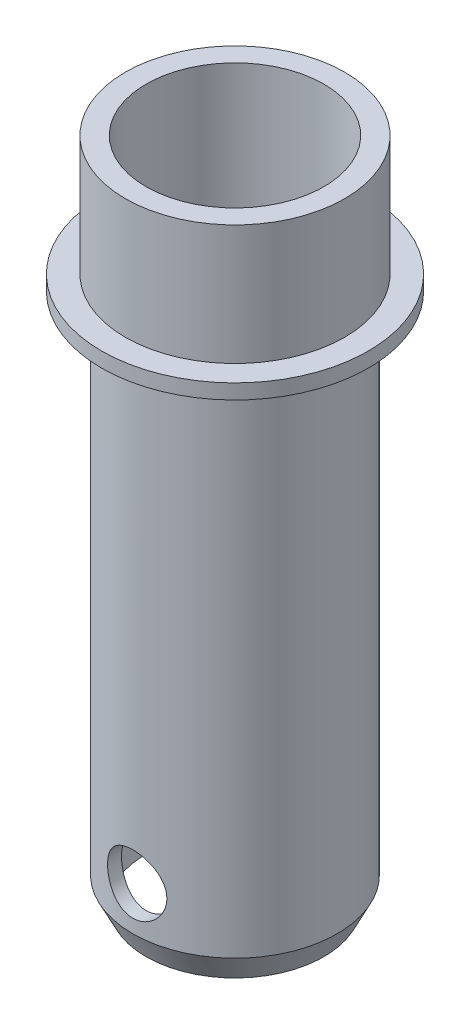
ISO-10303-21;
HEADER;
FILE_DESCRIPTION(('STEP AP214'),'2;1');
FILE_NAME('part.step','',(''),(''),'','','');
FILE_SCHEMA(('AUTOMOTIVE_DESIGN { 1 0 10303 214 1 1 1 1 }'));
ENDSEC;
DATA;
#1=APPLICATION_CONTEXT('core data for automotive mechanical design processes');
#2=APPLICATION_PROTOCOL_DEFINITION('international standard','automotive_design',2000,#1);
#3=PRODUCT_CONTEXT('',#1,'mechanical');
#4=PRODUCT('Part','Part','',(#3));
#5=PRODUCT_RELATED_PRODUCT_CATEGORY('part','',(#4));
#6=PRODUCT_DEFINITION_FORMATION('','',#4);
#7=PRODUCT_DEFINITION_CONTEXT('part definition',#1,'design');
#8=PRODUCT_DEFINITION('design','',#6,#7);
#9=PRODUCT_DEFINITION_SHAPE('','',#8);
#10=(LENGTH_UNIT() NAMED_UNIT(*) SI_UNIT(.MILLI.,.METRE.));
#11=(NAMED_UNIT(*) PLANE_ANGLE_UNIT() SI_UNIT($,.RADIAN.));
#12=(NAMED_UNIT(*) SI_UNIT($,.STERADIAN.) SOLID_ANGLE_UNIT());
#13=UNCERTAINTY_MEASURE_WITH_UNIT(LENGTH_MEASURE(1.E-05),#10,'distance_accuracy_value','');
#14=(GEOMETRIC_REPRESENTATION_CONTEXT(3) GLOBAL_UNCERTAINTY_ASSIGNED_CONTEXT((#13)) GLOBAL_UNIT_ASSIGNED_CONTEXT((#10,
#11,#12)) REPRESENTATION_CONTEXT('',''));
#15=CARTESIAN_POINT('',(0.,0.,0.));
#16=DIRECTION('',(0.,0.,1.));
#17=DIRECTION('',(1.,0.,0.));
#18=AXIS2_PLACEMENT_3D('',#15,#16,#17);
#19=CARTESIAN_POINT('',(0.,30.7122905027933,0.));
#20=DIRECTION('',(0.,1.,0.));
#21=DIRECTION('',(0.,0.,1.));
#22=AXIS2_PLACEMENT_3D('',#19,#20,#21);
#23=CYLINDRICAL_SURFACE('',#22,5.99999999999999);
#24=CARTESIAN_POINT('',(0.,-33.2,5.99999999999999));
#25=CARTESIAN_POINT('',(-0.109126725773446,-33.2000005074633,6.00000030601887));
#26=CARTESIAN_POINT('',(-0.2182503890771,-33.1910394677456,5.99699539015089));
#27=CARTESIAN_POINT('',(-0.433283521745944,-33.1555417823656,5.98530420406561));
#28=CARTESIAN_POINT('',(-0.539192656237635,-33.1290033121022,5.97661734404304));
#29=CARTESIAN_POINT('',(-0.744665579003551,-33.0593615132319,5.95450615812885));
#30=CARTESIAN_POINT('',(-0.844239651772067,-33.0162858750815,5.94108975461706));
#31=CARTESIAN_POINT('',(-1.03474987361065,-32.9149176543233,5.91088891434683));
#32=CARTESIAN_POINT('',(-1.12568431391741,-32.8566220699948,5.89410381335555));
#33=CARTESIAN_POINT('',(-1.29948335004453,-32.7243483902825,5.85828188886009));
#34=CARTESIAN_POINT('',(-1.38200740059662,-32.649937531479,5.83919112927569));
#35=CARTESIAN_POINT('',(-1.53366538540417,-32.4884656905869,5.80120629566242));
#36=CARTESIAN_POINT('',(-1.60279637097892,-32.401401930143,5.78231226581097));
#37=CARTESIAN_POINT('',(-1.72764988445572,-32.2140297696071,5.74626664954547));
#38=CARTESIAN_POINT('',(-1.78292971644206,-32.1134125205358,5.72918078551375));
#39=CARTESIAN_POINT('',(-1.87563774775544,-31.9036478110829,5.69950610837201));
#40=CARTESIAN_POINT('',(-1.91307139477353,-31.7945029656745,5.6869159232149));
#41=CARTESIAN_POINT('',(-1.96774692301833,-31.5746535570066,5.66822606538754));
#42=CARTESIAN_POINT('',(-1.98562689654354,-31.4641255830219,5.66192191539222));
#43=CARTESIAN_POINT('',(-2.00268224666896,-31.2414724916882,5.65591313259014));
#44=CARTESIAN_POINT('',(-2.00186340320944,-31.1293478785816,5.65620646045459));
#45=CARTESIAN_POINT('',(-1.98203980740684,-30.912126739112,5.66318030016359));
#46=CARTESIAN_POINT('',(-1.96386782633399,-30.806943194162,5.66956831735065));
#47=CARTESIAN_POINT('',(-1.91121232569884,-30.6012131607863,5.68753315449101));
#48=CARTESIAN_POINT('',(-1.87672685318374,-30.5006672291299,5.69911059568214));
#49=CARTESIAN_POINT('',(-1.79187811612042,-30.305174500817,5.72635822262497));
#50=CARTESIAN_POINT('',(-1.74126809741453,-30.210343949061,5.74209131586234));
#51=CARTESIAN_POINT('',(-1.62577821260628,-30.0302581834406,5.77585117151452));
#52=CARTESIAN_POINT('',(-1.56089422472801,-29.9450057461332,5.79387859580926));
#53=CARTESIAN_POINT('',(-1.41469866536448,-29.7818168036785,5.83134658335481));
#54=CARTESIAN_POINT('',(-1.33270630015262,-29.7044946109819,5.85081178709685));
#55=CARTESIAN_POINT('',(-1.15667913994013,-29.5645374666732,5.88813876774073));
#56=CARTESIAN_POINT('',(-1.06264319132163,-29.501903923671,5.90600039076134));
#57=CARTESIAN_POINT('',(-0.863895226092539,-29.3926073995299,5.93834215875586));
#58=CARTESIAN_POINT('',(-0.759086552832677,-29.3461090173185,5.95278700016078));
#59=CARTESIAN_POINT('',(-0.542538166729018,-29.2715936520886,5.97641134288869));
#60=CARTESIAN_POINT('',(-0.43080087630991,-29.2435702491531,5.98559267309758));
#61=CARTESIAN_POINT('',(-0.20876765905861,-29.2078886679553,5.9973525414288));
#62=CARTESIAN_POINT('',(-0.0986191997296948,-29.1994003816545,6.00020003667455));
#63=CARTESIAN_POINT('',(0.121550139920472,-29.2006653471969,5.99977805389654));
#64=CARTESIAN_POINT('',(0.231571038639298,-29.2104155199598,5.99650960838724));
#65=CARTESIAN_POINT('',(0.445039732608509,-29.2472238154719,5.98440049434208));
#66=CARTESIAN_POINT('',(0.548585613669685,-29.273772412099,5.97572397422384));
#67=CARTESIAN_POINT('',(0.749711917159145,-29.3427868889335,5.95383693660139));
#68=CARTESIAN_POINT('',(0.84729157701721,-29.3852547989356,5.94062584093349));
#69=CARTESIAN_POINT('',(1.03657659278654,-29.4861408636816,5.91057862574579));
#70=CARTESIAN_POINT('',(1.12805991843429,-29.5449491865663,5.89365629511571));
#71=CARTESIAN_POINT('',(1.30012966027117,-29.676388300027,5.85810507832524));
#72=CARTESIAN_POINT('',(1.38071273559115,-29.7490233120635,5.83947567187654));
#73=CARTESIAN_POINT('',(1.5325050156126,-29.9099575020132,5.80153695960889));
#74=CARTESIAN_POINT('',(1.60312193849154,-29.9988184538537,5.78223522174855));
#75=CARTESIAN_POINT('',(1.72851504464715,-30.1875431356218,5.74599946589417));
#76=CARTESIAN_POINT('',(1.78329109586203,-30.2874069572682,5.72906546764004));
#77=CARTESIAN_POINT('',(1.87519386083272,-30.4953460305798,5.69964783582766));
#78=CARTESIAN_POINT('',(1.91235626433004,-30.6034041583375,5.68715521585957));
#79=CARTESIAN_POINT('',(1.96778933351871,-30.8247573000883,5.66821664612898));
#80=CARTESIAN_POINT('',(1.98606850990788,-30.9380499308087,5.66176797247278));
#81=CARTESIAN_POINT('',(2.00255256495468,-31.1603941920818,5.65595717748353));
#82=CARTESIAN_POINT('',(2.0017405146168,-31.2693646805736,5.65624800514829));
#83=CARTESIAN_POINT('',(1.98248458689739,-31.4855301498441,5.66302539647734));
#84=CARTESIAN_POINT('',(1.96404175891717,-31.5927252359102,5.66951159138722));
#85=CARTESIAN_POINT('',(1.91074362625869,-31.8002713260049,5.68769048609783));
#86=CARTESIAN_POINT('',(1.87620669203103,-31.900713650009,5.69928196044954));
#87=CARTESIAN_POINT('',(1.7919587315195,-32.0944548138765,5.72632797636936));
#88=CARTESIAN_POINT('',(1.74224433710761,-32.187752062376,5.74178337526785));
#89=CARTESIAN_POINT('',(1.62652138516686,-32.3689673398458,5.77565658452092));
#90=CARTESIAN_POINT('',(1.55989648552916,-32.4564730037968,5.79417423284273));
#91=CARTESIAN_POINT('',(1.4132857662713,-32.6193796267684,5.83166712566505));
#92=CARTESIAN_POINT('',(1.33329616890297,-32.6947771513762,5.85064249824744));
#93=CARTESIAN_POINT('',(1.15848311384138,-32.8342888245784,5.88780061051087));
#94=CARTESIAN_POINT('',(1.06320302699947,-32.897848695502,5.90592363602512));
#95=CARTESIAN_POINT('',(0.862714714813257,-33.0079808577013,5.93851982345223));
#96=CARTESIAN_POINT('',(0.757509036264702,-33.0545574918441,5.95299391815859));
#97=CARTESIAN_POINT('',(0.544987294401954,-33.1274432649773,5.97611030137083));
#98=CARTESIAN_POINT('',(0.437975515352819,-33.1545649325268,5.98498424845044));
#99=CARTESIAN_POINT('',(0.220640832020495,-33.1908405613543,5.99692814128443));
#100=CARTESIAN_POINT('',(0.110318851137493,-33.1999994869931,5.99999969063809));
#101=CARTESIAN_POINT('',(0.,-33.2,5.99999999999999));
#102=B_SPLINE_CURVE_WITH_KNOTS('',3,(#24,#25,#26,#27,#28,#29,#30,#31,#32,#33,#34,#35,#36,#37,
#38,#39,#40,#41,#42,#43,#44,#45,#46,#47,#48,#49,#50,#51,#52,#53,#54,#55,#56,#57,#58,#59,#60,#61,
#62,#63,#64,#65,#66,#67,#68,#69,#70,#71,#72,#73,#74,#75,#76,#77,#78,#79,#80,#81,#82,#83,#84,#85,
#86,#87,#88,#89,#90,#91,#92,#93,#94,#95,#96,#97,#98,#99,#100,#101),.UNSPECIFIED.,.T.,.F.,(4,2,2,
2,2,2,2,2,2,2,2,2,2,2,2,2,2,2,2,2,2,2,2,2,2,2,2,2,2,2,2,2,2,2,2,2,2,2,4),(0.,0.326974212052022,
0.65398237053504,0.980445345740546,1.3069727555982,1.64369368565512,1.9804886657506,
2.32696769646941,2.67334089385666,3.00803851483679,3.34263267974971,3.66193653102561,
3.98127861710964,4.30576342310261,4.63034205116414,4.97186611622734,5.31342291933236,
5.65836811300715,6.00319337754416,6.33307166350339,6.66289426328353,6.98316315956427,
7.30347290568208,7.63220799687473,7.96104361643782,8.30482045761504,8.64860016469993,
8.99168027653541,9.3346056941168,9.65991332128517,9.9852015870275,10.3043117416083,
10.6234927635195,10.9566013338361,11.2898042224756,11.635993216702,11.9820936230491,
12.3127311674763,12.6432773207628),.UNSPECIFIED.);
#103=CARTESIAN_POINT('',(0.,-33.2,5.99999999999999));
#104=VERTEX_POINT('',#103);
#105=EDGE_CURVE('E74',#104,#104,#102,.T.);
#106=ORIENTED_EDGE('',*,*,#105,.F.);
#107=EDGE_LOOP('',(#106));
#108=FACE_BOUND('',#107,.T.);
#109=CARTESIAN_POINT('',(2.,-31.2,-5.65685424949237));
#110=CARTESIAN_POINT('',(2.00000051589543,-31.0910636503279,-5.65685389060867));
#111=CARTESIAN_POINT('',(1.99106956737105,-30.9821304003528,-5.66003538581714));
#112=CARTESIAN_POINT('',(1.95570226337762,-30.7674911580115,-5.67235148162509));
#113=CARTESIAN_POINT('',(1.9292630243368,-30.6617857002551,-5.68148706284377));
#114=CARTESIAN_POINT('',(1.85991097136981,-30.4567462140054,-5.70456407377582));
#115=CARTESIAN_POINT('',(1.81703044280649,-30.3574001411146,-5.71849607942643));
#116=CARTESIAN_POINT('',(1.71612325688276,-30.1672799029041,-5.74958244020649));
#117=CARTESIAN_POINT('',(1.65809325772037,-30.0765076348927,-5.76673750607224));
#118=CARTESIAN_POINT('',(1.52610229288576,-29.9025600753234,-5.80308978814945));
#119=CARTESIAN_POINT('',(1.45164868275584,-29.8197691426566,-5.82233789689287));
#120=CARTESIAN_POINT('',(1.28997533442879,-29.6675863975507,-5.86027729602005));
#121=CARTESIAN_POINT('',(1.20275355010475,-29.5981967368353,-5.87896849657922));
#122=CARTESIAN_POINT('',(1.01520901593002,-29.4730422053408,-5.91427733843597));
#123=CARTESIAN_POINT('',(0.914603822449051,-29.4176800587641,-5.9308281540321));
#124=CARTESIAN_POINT('',(0.704862445974948,-29.324816829745,-5.95939173541965));
#125=CARTESIAN_POINT('',(0.595728571374425,-29.2873109336462,-5.97140572406003));
#126=CARTESIAN_POINT('',(0.37605763486699,-29.2325282907352,-5.98918150863812));
#127=CARTESIAN_POINT('',(0.265701509705938,-29.214593107486,-5.99514629555117));
#128=CARTESIAN_POINT('',(0.0433957496481806,-29.1973674132787,-6.00087216436495));
#129=CARTESIAN_POINT('',(-0.0685534670877907,-29.1980720966952,-6.0006348452579));
#130=CARTESIAN_POINT('',(-0.286207030387627,-29.2176885091321,-5.99412079237462));
#131=CARTESIAN_POINT('',(-0.391984097183312,-29.235885056949,-5.98808129510234));
#132=CARTESIAN_POINT('',(-0.598886877644342,-29.2887859619609,-5.97093934679462));
#133=CARTESIAN_POINT('',(-0.700012275558431,-29.3234914379596,-5.95983655262363));
#134=CARTESIAN_POINT('',(-0.896304949683944,-29.4088426346121,-5.93351340586448));
#135=CARTESIAN_POINT('',(-0.991376441937689,-29.459691877093,-5.9182408504803));
#136=CARTESIAN_POINT('',(-1.17184865105464,-29.5757194108973,-5.88516786077837));
#137=CARTESIAN_POINT('',(-1.25724666877068,-29.6409016866553,-5.86736672402933));
#138=CARTESIAN_POINT('',(-1.42020173310261,-29.7873487869194,-5.83012383699792));
#139=CARTESIAN_POINT('',(-1.49720031413054,-29.869226315683,-5.81064430337755));
#140=CARTESIAN_POINT('',(-1.63655451919635,-30.0448974514532,-5.772946704978));
#141=CARTESIAN_POINT('',(-1.69890788656308,-30.1386928914561,-5.7547288349123));
#142=CARTESIAN_POINT('',(-1.80797491007148,-30.3373072512069,-5.72141050242224));
#143=CARTESIAN_POINT('',(-1.85445292724268,-30.4422642626355,-5.70635818569495));
#144=CARTESIAN_POINT('',(-1.92888638653867,-30.6591427884288,-5.68163301648769));
#145=CARTESIAN_POINT('',(-1.95684959149499,-30.7710613624125,-5.67195790974184));
#146=CARTESIAN_POINT('',(-1.99232256419504,-30.9932767108231,-5.65959272631169));
#147=CARTESIAN_POINT('',(-2.00069819101527,-31.1034188494973,-5.65660720637511));
#148=CARTESIAN_POINT('',(-1.99921087781944,-31.3235522982282,-5.65713344118368));
#149=CARTESIAN_POINT('',(-1.98935125045353,-31.433543632048,-5.66064401583628));
#150=CARTESIAN_POINT('',(-1.95245130310462,-31.6463139314238,-5.67347236180598));
#151=CARTESIAN_POINT('',(-1.92601278796137,-31.7492108603017,-5.6825865088168));
#152=CARTESIAN_POINT('',(-1.85742772512093,-31.9490872124784,-5.70537107342045));
#153=CARTESIAN_POINT('',(-1.81527839272684,-32.0460655831816,-5.71904229869678));
#154=CARTESIAN_POINT('',(-1.71494868147787,-32.234760841694,-5.74993755191573));
#155=CARTESIAN_POINT('',(-1.65630223671699,-32.3262132852836,-5.76726051331256));
#156=CARTESIAN_POINT('',(-1.52517126111512,-32.4982921047674,-5.8033153746193));
#157=CARTESIAN_POINT('',(-1.45268265099756,-32.5789152773224,-5.82204768887588));
#158=CARTESIAN_POINT('',(-1.29178341180065,-32.7310559681813,-5.85990077275697));
#159=CARTESIAN_POINT('',(-1.2027745410933,-32.8019487800377,-5.87899687155792));
#160=CARTESIAN_POINT('',(-1.01365458280051,-32.9278322846961,-5.91453703226217));
#161=CARTESIAN_POINT('',(-0.913543889729103,-32.9828235423249,-5.93098118835389));
#162=CARTESIAN_POINT('',(-0.705559724864591,-33.0748402097234,-5.95928811621205));
#163=CARTESIAN_POINT('',(-0.597742246642392,-33.1119825542961,-5.97118060009061));
#164=CARTESIAN_POINT('',(-0.376916931692033,-33.1674554841202,-5.98917221675548));
#165=CARTESIAN_POINT('',(-0.26391098390778,-33.185792859761,-5.99527344068037));
#166=CARTESIAN_POINT('',(-0.0416306717200848,-33.2025241552113,-6.00083726472512));
#167=CARTESIAN_POINT('',(0.0675694478400343,-33.2018149078648,-6.00059840178878));
#168=CARTESIAN_POINT('',(0.284222290000345,-33.1826853837072,-5.99424393038795));
#169=CARTESIAN_POINT('',(0.391675153638112,-33.1642665436945,-5.98812879867151));
#170=CARTESIAN_POINT('',(0.600084238864117,-33.1108355308481,-5.97081829908824));
#171=CARTESIAN_POINT('',(0.701116541825579,-33.0760915692941,-5.95970516722296));
#172=CARTESIAN_POINT('',(0.895956701879592,-32.9912449378057,-5.93354321408989));
#173=CARTESIAN_POINT('',(0.989763248284865,-32.941139489606,-5.91849368096032));
#174=CARTESIAN_POINT('',(1.17126803261757,-32.824860975796,-5.88531737655761));
#175=CARTESIAN_POINT('',(1.25861250311522,-32.7581626292367,-5.86709744983852));
#176=CARTESIAN_POINT('',(1.42116205254486,-32.6114852176876,-5.82985977583758));
#177=CARTESIAN_POINT('',(1.49636324324918,-32.5315019154745,-5.81084177546193));
#178=CARTESIAN_POINT('',(1.63548361766623,-32.3567812888261,-5.77326559651195));
#179=CARTESIAN_POINT('',(1.6988459319958,-32.2615889780467,-5.7547545597726));
#180=CARTESIAN_POINT('',(1.80862868660223,-32.0613311461944,-5.7212038664603));
#181=CARTESIAN_POINT('',(1.85505355363895,-31.9562682139407,-5.70616330322498));
#182=CARTESIAN_POINT('',(1.92768765640833,-31.7440763519687,-5.68202668413028));
#183=CARTESIAN_POINT('',(1.95471581829904,-31.6372554729493,-5.67269265714364));
#184=CARTESIAN_POINT('',(1.99086864029853,-31.4202878990666,-5.66010767079036));
#185=CARTESIAN_POINT('',(1.99999947839319,-31.3101423651786,-5.65685461234921));
#186=CARTESIAN_POINT('',(2.,-31.2,-5.65685424949237));
#187=B_SPLINE_CURVE_WITH_KNOTS('',3,(#109,#110,#111,#112,#113,#114,#115,#116,#117,#118,#119,
#120,#121,#122,#123,#124,#125,#126,#127,#128,#129,#130,#131,#132,#133,#134,#135,#136,#137,#138,
#139,#140,#141,#142,#143,#144,#145,#146,#147,#148,#149,#150,#151,#152,#153,#154,#155,#156,#157,
#158,#159,#160,#161,#162,#163,#164,#165,#166,#167,#168,#169,#170,#171,#172,#173,#174,#175,#176,
#177,#178,#179,#180,#181,#182,#183,#184,#185,#186),.UNSPECIFIED.,.T.,.F.,(4,2,2,2,2,2,2,2,2,2,2,
2,2,2,2,2,2,2,2,2,2,2,2,2,2,2,2,2,2,2,2,2,2,2,2,2,2,2,4),(0.,0.326401169598711,
0.652856110030327,0.978673255001652,1.30456233237088,1.64202674855136,1.97954530343976,
2.32587012287314,2.67210152773578,3.00628637529868,3.34038506604654,3.66138009651138,
3.98239688378473,4.3076330972067,4.63295983748044,4.97360348727835,5.31429959224212,
5.65985279686111,6.00526102713232,6.33508582728879,6.66485071674468,6.98328791537553,
7.30178158293892,7.6303771547143,7.95906971324255,8.30357616342186,8.64807037515065,
8.99027582381704,9.33235766008313,9.65836169355271,9.98433928019563,10.3051391208086,
10.6259970152649,10.9587103904127,11.2915300886526,11.6373780547229,11.9831355653373,
12.3132642432538,12.6432789438093),.UNSPECIFIED.);
#188=CARTESIAN_POINT('',(2.,-31.2,-5.65685424949237));
#189=VERTEX_POINT('',#188);
#190=EDGE_CURVE('E70',#189,#189,#187,.T.);
#191=ORIENTED_EDGE('',*,*,#190,.F.);
#192=EDGE_LOOP('',(#191));
#193=FACE_BOUND('',#192,.T.);
#194=CARTESIAN_POINT('',(0.,9.1,0.));
#195=DIRECTION('',(0.,1.,0.));
#196=DIRECTION('',(0.,0.,1.));
#197=AXIS2_PLACEMENT_3D('',#194,#195,#196);
#198=CIRCLE('',#197,5.99999999999999);
#199=CARTESIAN_POINT('',(0.,9.1,5.99999999999999));
#200=VERTEX_POINT('',#199);
#201=EDGE_CURVE('E10',#200,#200,#198,.T.);
#202=ORIENTED_EDGE('',*,*,#201,.T.);
#203=EDGE_LOOP('',(#202));
#204=FACE_BOUND('',#203,.T.);
#205=CARTESIAN_POINT('',(0.,-35.9,0.));
#206=DIRECTION('',(0.,1.,0.));
#207=DIRECTION('',(0.,0.,1.));
#208=AXIS2_PLACEMENT_3D('',#205,#206,#207);
#209=CIRCLE('',#208,5.99999999999999);
#210=CARTESIAN_POINT('',(0.,-35.9,5.99999999999999));
#211=VERTEX_POINT('',#210);
#212=EDGE_CURVE('E79',#211,#211,#209,.T.);
#213=ORIENTED_EDGE('',*,*,#212,.F.);
#214=EDGE_LOOP('',(#213));
#215=FACE_BOUND('',#214,.T.);
#216=ADVANCED_FACE('F31',(#108,#193,#204,#215),#23,.F.);
#217=CARTESIAN_POINT('',(-5.99999999999999,9.1,0.));
#218=DIRECTION('',(0.,1.,0.));
#219=DIRECTION('',(0.,0.,1.));
#220=AXIS2_PLACEMENT_3D('',#217,#218,#219);
#221=PLANE('',#220);
#222=CARTESIAN_POINT('',(0.,9.1,0.));
#223=DIRECTION('',(0.,1.,0.));
#224=DIRECTION('',(0.,0.,1.));
#225=AXIS2_PLACEMENT_3D('',#222,#223,#224);
#226=CIRCLE('',#225,7.4);
#227=CARTESIAN_POINT('',(0.,9.1,7.4));
#228=VERTEX_POINT('',#227);
#229=EDGE_CURVE('E43',#228,#228,#226,.T.);
#230=ORIENTED_EDGE('',*,*,#229,.T.);
#231=EDGE_LOOP('',(#230));
#232=FACE_BOUND('',#231,.T.);
#233=ORIENTED_EDGE('',*,*,#201,.F.);
#234=EDGE_LOOP('',(#233));
#235=FACE_BOUND('',#234,.T.);
#236=ADVANCED_FACE('F111',(#232,#235),#221,.T.);
#237=CARTESIAN_POINT('',(0.,30.7122905027933,0.));
#238=DIRECTION('',(0.,1.,0.));
#239=DIRECTION('',(0.,0.,1.));
#240=AXIS2_PLACEMENT_3D('',#237,#238,#239);
#241=CYLINDRICAL_SURFACE('',#240,7.4);
#242=CARTESIAN_POINT('',(0.,1.,0.));
#243=DIRECTION('',(0.,1.,0.));
#244=DIRECTION('',(0.,0.,1.));
#245=AXIS2_PLACEMENT_3D('',#242,#243,#244);
#246=CIRCLE('',#245,7.4);
#247=CARTESIAN_POINT('',(0.,1.,7.4));
#248=VERTEX_POINT('',#247);
#249=EDGE_CURVE('E48',#248,#248,#246,.T.);
#250=ORIENTED_EDGE('',*,*,#249,.T.);
#251=EDGE_LOOP('',(#250));
#252=FACE_BOUND('',#251,.T.);
#253=ORIENTED_EDGE('',*,*,#229,.F.);
#254=EDGE_LOOP('',(#253));
#255=FACE_BOUND('',#254,.T.);
#256=ADVANCED_FACE('F96',(#252,#255),#241,.T.);
#257=CARTESIAN_POINT('',(-7.4,1.,0.));
#258=DIRECTION('',(0.,1.,0.));
#259=DIRECTION('',(0.,0.,1.));
#260=AXIS2_PLACEMENT_3D('',#257,#258,#259);
#261=PLANE('',#260);
#262=CARTESIAN_POINT('',(0.,1.,0.));
#263=DIRECTION('',(0.,1.,0.));
#264=DIRECTION('',(0.,0.,1.));
#265=AXIS2_PLACEMENT_3D('',#262,#263,#264);
#266=CIRCLE('',#265,9.);
#267=CARTESIAN_POINT('',(0.,1.,9.));
#268=VERTEX_POINT('',#267);
#269=EDGE_CURVE('E91',#268,#268,#266,.T.);
#270=ORIENTED_EDGE('',*,*,#269,.T.);
#271=EDGE_LOOP('',(#270));
#272=FACE_BOUND('',#271,.T.);
#273=ORIENTED_EDGE('',*,*,#249,.F.);
#274=EDGE_LOOP('',(#273));
#275=FACE_BOUND('',#274,.T.);
#276=ADVANCED_FACE('F99',(#272,#275),#261,.T.);
#277=CARTESIAN_POINT('',(0.,30.7122905027933,0.));
#278=DIRECTION('',(0.,1.,0.));
#279=DIRECTION('',(0.,0.,1.));
#280=AXIS2_PLACEMENT_3D('',#277,#278,#279);
#281=CYLINDRICAL_SURFACE('',#280,9.);
#282=CARTESIAN_POINT('',(0.,0.,0.));
#283=DIRECTION('',(0.,1.,0.));
#284=DIRECTION('',(0.,0.,1.));
#285=AXIS2_PLACEMENT_3D('',#282,#283,#284);
#286=CIRCLE('',#285,9.);
#287=CARTESIAN_POINT('',(0.,0.,9.));
#288=VERTEX_POINT('',#287);
#289=EDGE_CURVE('E88',#288,#288,#286,.T.);
#290=ORIENTED_EDGE('',*,*,#289,.T.);
#291=EDGE_LOOP('',(#290));
#292=FACE_BOUND('',#291,.T.);
#293=ORIENTED_EDGE('',*,*,#269,.F.);
#294=EDGE_LOOP('',(#293));
#295=FACE_BOUND('',#294,.T.);
#296=ADVANCED_FACE('F101',(#292,#295),#281,.T.);
#297=CARTESIAN_POINT('',(-9.,0.,0.));
#298=DIRECTION('',(0.,-1.,0.));
#299=DIRECTION('',(0.,0.,-1.));
#300=AXIS2_PLACEMENT_3D('',#297,#298,#299);
#301=PLANE('',#300);
#302=CARTESIAN_POINT('',(0.,0.,0.));
#303=DIRECTION('',(0.,1.,0.));
#304=DIRECTION('',(0.,0.,1.));
#305=AXIS2_PLACEMENT_3D('',#302,#303,#304);
#306=CIRCLE('',#305,6.89412155415911);
#307=CARTESIAN_POINT('',(0.,0.,6.89412155415911));
#308=VERTEX_POINT('',#307);
#309=EDGE_CURVE('E85',#308,#308,#306,.T.);
#310=ORIENTED_EDGE('',*,*,#309,.T.);
#311=EDGE_LOOP('',(#310));
#312=FACE_BOUND('',#311,.T.);
#313=ORIENTED_EDGE('',*,*,#289,.F.);
#314=EDGE_LOOP('',(#313));
#315=FACE_BOUND('',#314,.T.);
#316=ADVANCED_FACE('F108',(#312,#315),#301,.T.);
#317=CARTESIAN_POINT('',(0.,30.7122905027933,0.));
#318=DIRECTION('',(0.,1.,0.));
#319=DIRECTION('',(0.,0.,1.));
#320=AXIS2_PLACEMENT_3D('',#317,#318,#319);
#321=CYLINDRICAL_SURFACE('',#320,6.89412155415911);
#322=CARTESIAN_POINT('',(0.,-33.2,6.89412155415911));
#323=CARTESIAN_POINT('',(0.109883268283516,-33.1999982377368,6.89412034925704));
#324=CARTESIAN_POINT('',(0.21978452487831,-33.1909141090073,6.89146911431886));
#325=CARTESIAN_POINT('',(0.436397133435724,-33.1548970417176,6.88115132109162));
#326=CARTESIAN_POINT('',(0.543107342003724,-33.127957783655,6.87348298710279));
#327=CARTESIAN_POINT('',(0.750181575489398,-33.0571979323901,6.85397314241053));
#328=CARTESIAN_POINT('',(0.850554371048414,-33.0134012926988,6.8421375551939));
#329=CARTESIAN_POINT('',(1.04253145722823,-32.9102652704214,6.81552967111487));
#330=CARTESIAN_POINT('',(1.13413475211872,-32.8509241256906,6.80075704135139));
#331=CARTESIAN_POINT('',(1.30844816293897,-32.7166925927356,6.76941029981221));
#332=CARTESIAN_POINT('',(1.39088769581778,-32.6414590301625,6.75280110363177));
#333=CARTESIAN_POINT('',(1.54217465015598,-32.4783103121638,6.71986727697366));
#334=CARTESIAN_POINT('',(1.61101996019081,-32.3903931904201,6.70354269105945));
#335=CARTESIAN_POINT('',(1.73455546932881,-32.2021236829026,6.67265913564114));
#336=CARTESIAN_POINT('',(1.78892128687443,-32.1015505924243,6.65814397804985));
#337=CARTESIAN_POINT('',(1.87986001955868,-31.8922008715342,6.63304452236702));
#338=CARTESIAN_POINT('',(1.91643689588919,-31.7834260736927,6.6224593492818));
#339=CARTESIAN_POINT('',(1.96979480579694,-31.5637868465034,6.60678293120807));
#340=CARTESIAN_POINT('',(1.98707221664186,-31.4530530707046,6.60155422848316));
#341=CARTESIAN_POINT('',(2.00289006587895,-31.2301447165347,6.59677327902421));
#342=CARTESIAN_POINT('',(2.00143471557121,-31.11797046766,6.59721975645626));
#343=CARTESIAN_POINT('',(1.98021951717344,-30.8993505816717,6.6036165211757));
#344=CARTESIAN_POINT('',(1.96107480797862,-30.7928389532603,6.60938183807039));
#345=CARTESIAN_POINT('',(1.90601553401023,-30.5846091959777,6.62546838118117));
#346=CARTESIAN_POINT('',(1.87009941119119,-30.4828915134254,6.63579003067056));
#347=CARTESIAN_POINT('',(1.78204915485283,-30.2856021704513,6.65997842832175));
#348=CARTESIAN_POINT('',(1.72971059595342,-30.190127403728,6.67388944574305));
#349=CARTESIAN_POINT('',(1.61044338150736,-30.0091065002469,6.70366711063301));
#350=CARTESIAN_POINT('',(1.54351138989343,-29.9235626405636,6.71953420490096));
#351=CARTESIAN_POINT('',(1.39387432827021,-29.7613346606968,6.75219251147999));
#352=CARTESIAN_POINT('',(1.31065683058374,-29.6851248315362,6.76899565770768));
#353=CARTESIAN_POINT('',(1.13241411430108,-29.5476359355856,6.80108364833156));
#354=CARTESIAN_POINT('',(1.03738824594638,-29.4863576909595,6.81636840909487));
#355=CARTESIAN_POINT('',(0.837403749564484,-29.3802083749156,6.84382204268933));
#356=CARTESIAN_POINT('',(0.73238968466779,-29.3354365139469,6.85597194679601));
#357=CARTESIAN_POINT('',(0.515889285206857,-29.264326701648,6.87565023122648));
#358=CARTESIAN_POINT('',(0.404404642588193,-29.2379839547271,6.88317981377927));
#359=CARTESIAN_POINT('',(0.182164546056483,-29.2052558417709,6.89258147203898));
#360=CARTESIAN_POINT('',(0.0715114112422076,-29.1982270773671,6.89463586740963));
#361=CARTESIAN_POINT('',(-0.149397572156116,-29.2025312761809,6.89338725996807));
#362=CARTESIAN_POINT('',(-0.25965346831953,-29.2138619617946,6.89008492169186));
#363=CARTESIAN_POINT('',(-0.474250513442406,-29.2540406286296,6.87861282255987));
#364=CARTESIAN_POINT('',(-0.578667092769288,-29.2825179198946,6.87054613014403));
#365=CARTESIAN_POINT('',(-0.781222014293472,-29.3557402471988,6.85047240473081));
#366=CARTESIAN_POINT('',(-0.879359619523445,-29.4004871887137,6.83846491020897));
#367=CARTESIAN_POINT('',(-1.06897932274463,-29.5060931324671,6.81142989311631));
#368=CARTESIAN_POINT('',(-1.1602662833594,-29.5672865097337,6.79634146550057));
#369=CARTESIAN_POINT('',(-1.3314972078874,-29.703637795077,6.76488129371215));
#370=CARTESIAN_POINT('',(-1.41143850352515,-29.7787989785381,6.748509249059));
#371=CARTESIAN_POINT('',(-1.56050549481866,-29.9439706759265,6.71563587692162));
#372=CARTESIAN_POINT('',(-1.629174351475,-30.0343971961039,6.69914888035679));
#373=CARTESIAN_POINT('',(-1.75038826543813,-30.2258466218674,6.66850628183377));
#374=CARTESIAN_POINT('',(-1.80293384673284,-30.3268691829511,6.65435060411731));
#375=CARTESIAN_POINT('',(-1.89003241977478,-30.5362506830473,6.63013839941581));
#376=CARTESIAN_POINT('',(-1.92467770420454,-30.6445686681389,6.62006090517409));
#377=CARTESIAN_POINT('',(-1.97514719991699,-30.8658439428497,6.60518063223104));
#378=CARTESIAN_POINT('',(-1.99097733628559,-30.9787997603687,6.60037619302632));
#379=CARTESIAN_POINT('',(-2.00298262040504,-31.2014204811554,6.59674213753488));
#380=CARTESIAN_POINT('',(-1.99989906391434,-31.3110422747437,6.59768716675967));
#381=CARTESIAN_POINT('',(-1.97591860243418,-31.5281318183003,6.60490810456017));
#382=CARTESIAN_POINT('',(-1.95502232673376,-31.6355996442269,6.61118382481281));
#383=CARTESIAN_POINT('',(-1.89647385076401,-31.8442051905501,6.62821289801292));
#384=CARTESIAN_POINT('',(-1.85900584158091,-31.9453989247937,6.63891694879529));
#385=CARTESIAN_POINT('',(-1.76852013535455,-32.14014410003,6.66359045794743));
#386=CARTESIAN_POINT('',(-1.7154996163661,-32.2336941501626,6.67756050882734));
#387=CARTESIAN_POINT('',(-1.59328148053265,-32.4139671070897,6.70779041738925));
#388=CARTESIAN_POINT('',(-1.5235911905035,-32.5003455953624,6.72411239859405));
#389=CARTESIAN_POINT('',(-1.37091391933414,-32.6604224446678,6.75689231834188));
#390=CARTESIAN_POINT('',(-1.28792356374376,-32.7341175778529,6.77335029038032));
#391=CARTESIAN_POINT('',(-1.10832946897839,-32.8686905672387,6.80507467572249));
#392=CARTESIAN_POINT('',(-1.01142124863383,-32.9291733611679,6.82029750405531));
#393=CARTESIAN_POINT('',(-0.808369976251356,-33.0328990568997,6.84732876932218));
#394=CARTESIAN_POINT('',(-0.702231789218246,-33.0761509745923,6.85913899097884));
#395=CARTESIAN_POINT('',(-0.497372011987166,-33.1397566734679,6.87682771529014));
#396=CARTESIAN_POINT('',(-0.399370120569501,-33.1622895139383,6.8832613243204));
#397=CARTESIAN_POINT('',(-0.200916929721244,-33.1924109119054,6.89190849216395));
#398=CARTESIAN_POINT('',(-0.100465983432251,-33.2000016112327,6.89412265579791));
#399=CARTESIAN_POINT('',(0.,-33.2,6.89412155415911));
#400=B_SPLINE_CURVE_WITH_KNOTS('',3,(#322,#323,#324,#325,#326,#327,#328,#329,#330,#331,#332,
#333,#334,#335,#336,#337,#338,#339,#340,#341,#342,#343,#344,#345,#346,#347,#348,#349,#350,#351,
#352,#353,#354,#355,#356,#357,#358,#359,#360,#361,#362,#363,#364,#365,#366,#367,#368,#369,#370,
#371,#372,#373,#374,#375,#376,#377,#378,#379,#380,#381,#382,#383,#384,#385,#386,#387,#388,#389,
#390,#391,#392,#393,#394,#395,#396,#397,#398,#399),.UNSPECIFIED.,.T.,.F.,(4,2,2,2,2,2,2,2,2,2,2,
2,2,2,2,2,2,2,2,2,2,2,2,2,2,2,2,2,2,2,2,2,2,2,2,2,2,2,4),(0.,0.329280957743953,
0.658678520850207,0.9876097439214,1.31657827120205,1.65355029565675,1.99057461676277,
2.33461241037933,2.67857355950201,3.01346838784753,3.34828793001537,3.67188546899735,
3.99551307580928,4.32334066528662,4.65124327506378,4.99190555111576,5.3325865805009,
5.67528309738058,6.01789040518852,6.34893767894678,6.67994388737882,7.00403888975973,
7.3281718618666,7.6594716892357,7.99084930310142,8.33342632772603,8.67599221781139,
9.01677377960052,9.35744799727263,9.68485757936633,10.0122555951898,10.3361026867586,
10.6600085755669,10.9950290043676,11.3301345684437,11.6741935406202,12.0180722500576,
12.3191761282747,12.6202368426312),.UNSPECIFIED.);
#401=CARTESIAN_POINT('',(0.,-33.2,6.89412155415911));
#402=VERTEX_POINT('',#401);
#403=EDGE_CURVE('E35',#402,#402,#400,.T.);
#404=ORIENTED_EDGE('',*,*,#403,.F.);
#405=EDGE_LOOP('',(#404));
#406=FACE_BOUND('',#405,.T.);
#407=CARTESIAN_POINT('',(2.,-31.2,-6.59764442839422));
#408=CARTESIAN_POINT('',(1.99999819874114,-31.3097734652908,-6.5976458544307));
#409=CARTESIAN_POINT('',(1.99093157862297,-31.4195649796979,-6.60041406677035));
#410=CARTESIAN_POINT('',(1.95499035213173,-31.6359501789858,-6.61114708709121));
#411=CARTESIAN_POINT('',(1.92810889801769,-31.7425426177173,-6.61911389331173));
#412=CARTESIAN_POINT('',(1.85751790206238,-31.9493667262821,-6.63926752311153));
#413=CARTESIAN_POINT('',(1.81383499864238,-32.049608173955,-6.65144766345818));
#414=CARTESIAN_POINT('',(1.7109674859072,-32.2413618010493,-6.67864668947945));
#415=CARTESIAN_POINT('',(1.6517808886019,-32.3328728589457,-6.69366593913538));
#416=CARTESIAN_POINT('',(1.51771152113279,-32.5072759618782,-6.72534924687708));
#417=CARTESIAN_POINT('',(1.44245073700023,-32.589871434377,-6.74204658946447));
#418=CARTESIAN_POINT('',(1.27918037127196,-32.7414634340636,-6.77491949480016));
#419=CARTESIAN_POINT('',(1.1911692559375,-32.8104583228755,-6.7910949944893));
#420=CARTESIAN_POINT('',(1.00280317704505,-32.9341626402502,-6.8214777128776));
#421=CARTESIAN_POINT('',(0.902243470751799,-32.9885720036008,-6.83564112411126));
#422=CARTESIAN_POINT('',(0.692921860457335,-33.0795947822652,-6.8600186113868));
#423=CARTESIAN_POINT('',(0.584161610222135,-33.1162117746555,-6.87023348118074));
#424=CARTESIAN_POINT('',(0.364626852260827,-33.1696356129513,-6.8853274893083));
#425=CARTESIAN_POINT('',(0.253984921713141,-33.1869481600957,-6.89034258070543));
#426=CARTESIAN_POINT('',(0.0312608649789574,-33.2028682320774,-6.89494968529817));
#427=CARTESIAN_POINT('',(-0.0808209733543691,-33.201479439125,-6.89454276606364));
#428=CARTESIAN_POINT('',(-0.299704153669192,-33.1803808520297,-6.88844888628734));
#429=CARTESIAN_POINT('',(-0.406563319474091,-33.1612182808525,-6.88291963920434));
#430=CARTESIAN_POINT('',(-0.615478307045431,-33.1060069406735,-6.86739231834404));
#431=CARTESIAN_POINT('',(-0.717533832285858,-33.0699571307324,-6.85739396909042));
#432=CARTESIAN_POINT('',(-0.915274812063832,-32.9816093043812,-6.83382896317849));
#433=CARTESIAN_POINT('',(-1.01087649424339,-32.92913449819,-6.82022374036773));
#434=CARTESIAN_POINT('',(-1.19209594174732,-32.8095647169006,-6.7908952609294));
#435=CARTESIAN_POINT('',(-1.27771145690519,-32.7424664564561,-6.7751715286551));
#436=CARTESIAN_POINT('',(-1.43979499098369,-32.592695191148,-6.74262473909247));
#437=CARTESIAN_POINT('',(-1.51582057358146,-32.5095469356548,-6.72578248901538));
#438=CARTESIAN_POINT('',(-1.65296868332124,-32.3315132122018,-6.6933986582517));
#439=CARTESIAN_POINT('',(-1.71408992225773,-32.2366267307564,-6.6778571900699));
#440=CARTESIAN_POINT('',(-1.8201162006713,-32.0367093067208,-6.64974707853534));
#441=CARTESIAN_POINT('',(-1.8648797875751,-31.9315993881265,-6.63720467678384));
#442=CARTESIAN_POINT('',(-1.93594535429331,-31.714886972162,-6.61682777714734));
#443=CARTESIAN_POINT('',(-1.96225290053924,-31.6032864433976,-6.60899185986642));
#444=CARTESIAN_POINT('',(-1.99485265243692,-31.3809494353859,-6.5992239120337));
#445=CARTESIAN_POINT('',(-2.00181355887599,-31.2703195744428,-6.59709472934181));
#446=CARTESIAN_POINT('',(-1.99738218588507,-31.049471972597,-6.59843790139799));
#447=CARTESIAN_POINT('',(-1.98599227908051,-30.9392541802635,-6.60190953200209));
#448=CARTESIAN_POINT('',(-1.94577639050736,-30.7250816691817,-6.61387058010513));
#449=CARTESIAN_POINT('',(-1.91737208257219,-30.6210403072954,-6.62223853759109));
#450=CARTESIAN_POINT('',(-1.84441800534437,-30.4192040765138,-6.64292574184385));
#451=CARTESIAN_POINT('',(-1.79986585594435,-30.3214101309557,-6.65524557106506));
#452=CARTESIAN_POINT('',(-1.69458523611704,-30.1321009817699,-6.68283753237745));
#453=CARTESIAN_POINT('',(-1.63347483211427,-30.0408081879013,-6.69817667097016));
#454=CARTESIAN_POINT('',(-1.49727198461393,-29.8695283063658,-6.72993087926773));
#455=CARTESIAN_POINT('',(-1.42217641489878,-29.7895437535682,-6.74634618900519));
#456=CARTESIAN_POINT('',(-1.25700654276769,-29.6402722394522,-6.77909776324404));
#457=CARTESIAN_POINT('',(-1.16650035373892,-29.5714570433472,-6.79541119998736));
#458=CARTESIAN_POINT('',(-0.974841623570492,-29.4499849008294,-6.82553966820274));
#459=CARTESIAN_POINT('',(-0.873689632733746,-29.3973271197576,-6.83935482871547));
#460=CARTESIAN_POINT('',(-0.664303112732567,-29.3101697806314,-6.86284306686407));
#461=CARTESIAN_POINT('',(-0.556129359242006,-29.2755330390115,-6.87254732982026));
#462=CARTESIAN_POINT('',(-0.335167085921937,-29.2250323031192,-6.88685813232174));
#463=CARTESIAN_POINT('',(-0.222379801479999,-29.2091633169207,-6.89146602739911));
#464=CARTESIAN_POINT('',(0.000234195275339232,-29.1970079618866,-6.89498803310459));
#465=CARTESIAN_POINT('',(0.11002075453274,-29.200035184004,-6.89410173000188));
#466=CARTESIAN_POINT('',(0.327455308868053,-29.2239599500438,-6.8871994679403));
#467=CARTESIAN_POINT('',(0.435103411651949,-29.2448565916042,-6.88118376800353));
#468=CARTESIAN_POINT('',(0.644220905585818,-29.3035125846604,-6.86475046005816));
#469=CARTESIAN_POINT('',(0.745739146179885,-29.3411104096825,-6.85437506782139));
#470=CARTESIAN_POINT('',(0.941081774250495,-29.4319576659561,-6.83029822758741));
#471=CARTESIAN_POINT('',(1.03490494403278,-29.4852095682737,-6.81659625453404));
#472=CARTESIAN_POINT('',(1.21529550326277,-29.6077360562711,-6.78679501190695));
#473=CARTESIAN_POINT('',(1.30155512721231,-29.6774489936805,-6.77063546917599));
#474=CARTESIAN_POINT('',(1.46138219855563,-29.8301165064302,-6.73794792642049));
#475=CARTESIAN_POINT('',(1.53494608315762,-29.9130747862637,-6.7214198244322));
#476=CARTESIAN_POINT('',(1.66930420236373,-30.0926008568742,-6.68933825151825));
#477=CARTESIAN_POINT('',(1.72969460120261,-30.1894785744824,-6.67382375074743));
#478=CARTESIAN_POINT('',(1.8332549895361,-30.3924482069209,-6.64612513241676));
#479=CARTESIAN_POINT('',(1.87643421230972,-30.4985351439801,-6.63393923027107));
#480=CARTESIAN_POINT('',(1.93990262003071,-30.7032261577079,-6.61563589795319));
#481=CARTESIAN_POINT('',(1.96238000758402,-30.801105425295,-6.60894990796529));
#482=CARTESIAN_POINT('',(1.99242825440916,-30.9993183809852,-6.59995389316855));
#483=CARTESIAN_POINT('',(2.00000164660335,-31.0996516490978,-6.59764312479676));
#484=CARTESIAN_POINT('',(2.,-31.2,-6.59764442839422));
#485=B_SPLINE_CURVE_WITH_KNOTS('',3,(#407,#408,#409,#410,#411,#412,#413,#414,#415,#416,#417,
#418,#419,#420,#421,#422,#423,#424,#425,#426,#427,#428,#429,#430,#431,#432,#433,#434,#435,#436,
#437,#438,#439,#440,#441,#442,#443,#444,#445,#446,#447,#448,#449,#450,#451,#452,#453,#454,#455,
#456,#457,#458,#459,#460,#461,#462,#463,#464,#465,#466,#467,#468,#469,#470,#471,#472,#473,#474,
#475,#476,#477,#478,#479,#480,#481,#482,#483,#484),.UNSPECIFIED.,.T.,.F.,(4,2,2,2,2,2,2,2,2,2,2,
2,2,2,2,2,2,2,2,2,2,2,2,2,2,2,2,2,2,2,2,2,2,2,2,2,2,2,4),(0.,0.328950601174901,
0.658027719163745,0.986585227325217,1.31518488602802,1.65258751869089,1.99003077130522,
2.33395990985159,2.67781987434667,3.01244340589241,3.34700105252172,3.67158844814313,
3.99619585415372,4.324424820353,4.65272760354659,4.99289575066053,5.33309328862178,
5.67616670827937,6.01913661079121,6.35009519501633,6.68101099215998,7.0040465104661,
7.32712966189374,7.65841444147494,7.98977336491525,8.33271700653689,8.67564292941043,
9.01591868822433,9.3561039186997,9.68400556211669,10.0118906482771,10.3366713735759,
10.6615033945203,10.9962223902737,11.3310351656591,11.6749962652258,12.0187725908387,
12.3195307173257,12.6202377257885),.UNSPECIFIED.);
#486=CARTESIAN_POINT('',(2.,-31.2,-6.59764442839422));
#487=VERTEX_POINT('',#486);
#488=EDGE_CURVE('E51',#487,#487,#485,.T.);
#489=ORIENTED_EDGE('',*,*,#488,.F.);
#490=EDGE_LOOP('',(#489));
#491=FACE_BOUND('',#490,.T.);
#492=CARTESIAN_POINT('',(0.,-34.1109928322144,0.));
#493=DIRECTION('',(0.,1.,0.));
#494=DIRECTION('',(0.,0.,1.));
#495=AXIS2_PLACEMENT_3D('',#492,#493,#494);
#496=CIRCLE('',#495,6.89412155415911);
#497=CARTESIAN_POINT('',(0.,-34.1109928322144,6.89412155415911));
#498=VERTEX_POINT('',#497);
#499=EDGE_CURVE('E82',#498,#498,#496,.T.);
#500=ORIENTED_EDGE('',*,*,#499,.T.);
#501=EDGE_LOOP('',(#500));
#502=FACE_BOUND('',#501,.T.);
#503=ORIENTED_EDGE('',*,*,#309,.F.);
#504=EDGE_LOOP('',(#503));
#505=FACE_BOUND('',#504,.T.);
#506=ADVANCED_FACE('F55',(#406,#491,#502,#505),#321,.T.);
#507=CARTESIAN_POINT('',(0.,-34.1109928322144,0.));
#508=DIRECTION('',(0.,1.,0.));
#509=DIRECTION('',(0.,0.,1.));
#510=AXIS2_PLACEMENT_3D('',#507,#508,#509);
#511=CONICAL_SURFACE('',#510,6.89412155415911,0.463476760109195);
#512=ORIENTED_EDGE('',*,*,#212,.T.);
#513=EDGE_LOOP('',(#512));
#514=FACE_BOUND('',#513,.T.);
#515=ORIENTED_EDGE('',*,*,#499,.F.);
#516=EDGE_LOOP('',(#515));
#517=FACE_BOUND('',#516,.T.);
#518=ADVANCED_FACE('F63',(#514,#517),#511,.T.);
#519=CARTESIAN_POINT('',(0.,-31.2,-9.));
#520=DIRECTION('',(0.,0.,1.));
#521=DIRECTION('',(1.,0.,0.));
#522=AXIS2_PLACEMENT_3D('',#519,#520,#521);
#523=CYLINDRICAL_SURFACE('',#522,2.);
#524=ORIENTED_EDGE('',*,*,#190,.T.);
#525=EDGE_LOOP('',(#524));
#526=FACE_BOUND('',#525,.T.);
#527=ORIENTED_EDGE('',*,*,#488,.T.);
#528=EDGE_LOOP('',(#527));
#529=FACE_BOUND('',#528,.T.);
#530=ADVANCED_FACE('F59',(#526,#529),#523,.F.);
#531=ORIENTED_EDGE('',*,*,#105,.T.);
#532=EDGE_LOOP('',(#531));
#533=FACE_BOUND('',#532,.T.);
#534=ORIENTED_EDGE('',*,*,#403,.T.);
#535=EDGE_LOOP('',(#534));
#536=FACE_BOUND('',#535,.T.);
#537=ADVANCED_FACE('F62',(#533,#536),#523,.F.);
#538=CLOSED_SHELL('',(#216,#236,#256,#276,#296,#316,#506,#518,#530,#537));
#539=MANIFOLD_SOLID_BREP('B2',#538);
#540=ADVANCED_BREP_SHAPE_REPRESENTATION('',(#18,#539),#14);
#541=SHAPE_DEFINITION_REPRESENTATION(#9,#540);
ENDSEC;
END-ISO-10303-21;
